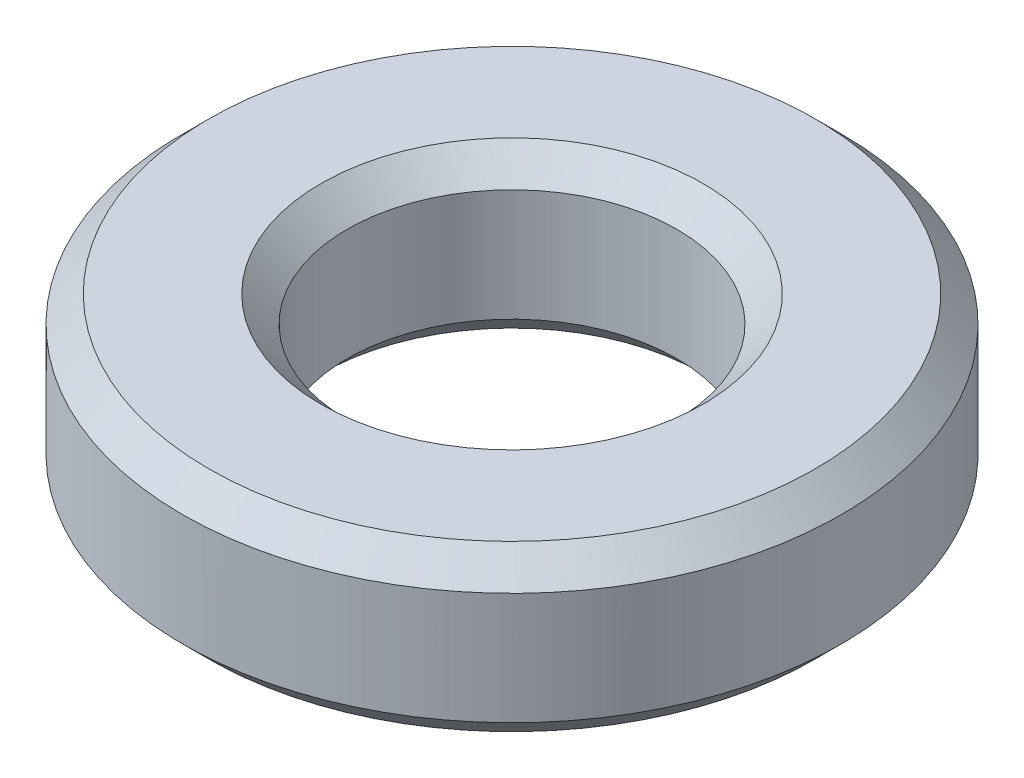
ISO-10303-21;
HEADER;
FILE_DESCRIPTION(('STEP AP214'),'2;1');
FILE_NAME('part.step','',(''),(''),'','','');
FILE_SCHEMA(('AUTOMOTIVE_DESIGN { 1 0 10303 214 1 1 1 1 }'));
ENDSEC;
DATA;
#1=APPLICATION_CONTEXT('core data for automotive mechanical design processes');
#2=APPLICATION_PROTOCOL_DEFINITION('international standard','automotive_design',2000,#1);
#3=PRODUCT_CONTEXT('',#1,'mechanical');
#4=PRODUCT('Part','Part','',(#3));
#5=PRODUCT_RELATED_PRODUCT_CATEGORY('part','',(#4));
#6=PRODUCT_DEFINITION_FORMATION('','',#4);
#7=PRODUCT_DEFINITION_CONTEXT('part definition',#1,'design');
#8=PRODUCT_DEFINITION('design','',#6,#7);
#9=PRODUCT_DEFINITION_SHAPE('','',#8);
#10=(LENGTH_UNIT() NAMED_UNIT(*) SI_UNIT(.MILLI.,.METRE.));
#11=(NAMED_UNIT(*) PLANE_ANGLE_UNIT() SI_UNIT($,.RADIAN.));
#12=(NAMED_UNIT(*) SI_UNIT($,.STERADIAN.) SOLID_ANGLE_UNIT());
#13=UNCERTAINTY_MEASURE_WITH_UNIT(LENGTH_MEASURE(1.E-05),#10,'distance_accuracy_value','');
#14=(GEOMETRIC_REPRESENTATION_CONTEXT(3) GLOBAL_UNCERTAINTY_ASSIGNED_CONTEXT((#13)) GLOBAL_UNIT_ASSIGNED_CONTEXT((#10,
#11,#12)) REPRESENTATION_CONTEXT('',''));
#15=CARTESIAN_POINT('',(0.,0.,0.));
#16=DIRECTION('',(0.,0.,1.));
#17=DIRECTION('',(1.,0.,0.));
#18=AXIS2_PLACEMENT_3D('',#15,#16,#17);
#19=CARTESIAN_POINT('',(0.,0.,0.));
#20=DIRECTION('',(0.,-1.,0.));
#21=DIRECTION('',(0.,0.,-1.));
#22=AXIS2_PLACEMENT_3D('',#19,#20,#21);
#23=CYLINDRICAL_SURFACE('',#22,1.5875);
#24=CARTESIAN_POINT('',(0.,0.539749999999998,0.));
#25=DIRECTION('',(0.,1.,0.));
#26=DIRECTION('',(0.,0.,1.));
#27=AXIS2_PLACEMENT_3D('',#24,#25,#26);
#28=CIRCLE('',#27,1.5875);
#29=CARTESIAN_POINT('',(0.,0.539749999999998,1.5875));
#30=VERTEX_POINT('',#29);
#31=EDGE_CURVE('E10',#30,#30,#28,.T.);
#32=ORIENTED_EDGE('',*,*,#31,.T.);
#33=EDGE_LOOP('',(#32));
#34=FACE_BOUND('',#33,.T.);
#35=CARTESIAN_POINT('',(0.,-0.539749999999999,0.));
#36=DIRECTION('',(0.,-1.,0.));
#37=DIRECTION('',(0.,0.,-1.));
#38=AXIS2_PLACEMENT_3D('',#35,#36,#37);
#39=CIRCLE('',#38,1.5875);
#40=CARTESIAN_POINT('',(0.,-0.539749999999999,-1.5875));
#41=VERTEX_POINT('',#40);
#42=EDGE_CURVE('E37',#41,#41,#39,.T.);
#43=ORIENTED_EDGE('',*,*,#42,.T.);
#44=EDGE_LOOP('',(#43));
#45=FACE_BOUND('',#44,.T.);
#46=ADVANCED_FACE('F30',(#34,#45),#23,.F.);
#47=CARTESIAN_POINT('',(1.5875,0.79375,0.));
#48=DIRECTION('',(0.,1.,0.));
#49=DIRECTION('',(0.,0.,1.));
#50=AXIS2_PLACEMENT_3D('',#47,#48,#49);
#51=PLANE('',#50);
#52=CARTESIAN_POINT('',(0.,0.79375,0.));
#53=DIRECTION('',(0.,1.,0.));
#54=DIRECTION('',(0.,0.,1.));
#55=AXIS2_PLACEMENT_3D('',#52,#53,#54);
#56=CIRCLE('',#55,2.921);
#57=CARTESIAN_POINT('',(0.,0.79375,2.921));
#58=VERTEX_POINT('',#57);
#59=EDGE_CURVE('E41',#58,#58,#56,.T.);
#60=ORIENTED_EDGE('',*,*,#59,.T.);
#61=EDGE_LOOP('',(#60));
#62=FACE_BOUND('',#61,.T.);
#63=CARTESIAN_POINT('',(0.,0.79375,0.));
#64=DIRECTION('',(0.,1.,0.));
#65=DIRECTION('',(0.,0.,1.));
#66=AXIS2_PLACEMENT_3D('',#63,#64,#65);
#67=CIRCLE('',#66,1.8415);
#68=CARTESIAN_POINT('',(0.,0.79375,1.8415));
#69=VERTEX_POINT('',#68);
#70=EDGE_CURVE('E45',#69,#69,#67,.F.);
#71=ORIENTED_EDGE('',*,*,#70,.T.);
#72=EDGE_LOOP('',(#71));
#73=FACE_BOUND('',#72,.T.);
#74=ADVANCED_FACE('F74',(#62,#73),#51,.T.);
#75=CARTESIAN_POINT('',(0.,0.,0.));
#76=DIRECTION('',(0.,-1.,0.));
#77=DIRECTION('',(0.,0.,-1.));
#78=AXIS2_PLACEMENT_3D('',#75,#76,#77);
#79=CYLINDRICAL_SURFACE('',#78,3.175);
#80=CARTESIAN_POINT('',(0.,-0.53975,0.));
#81=DIRECTION('',(0.,-1.,0.));
#82=DIRECTION('',(0.,0.,-1.));
#83=AXIS2_PLACEMENT_3D('',#80,#81,#82);
#84=CIRCLE('',#83,3.175);
#85=CARTESIAN_POINT('',(0.,-0.53975,-3.175));
#86=VERTEX_POINT('',#85);
#87=EDGE_CURVE('E50',#86,#86,#84,.F.);
#88=ORIENTED_EDGE('',*,*,#87,.T.);
#89=EDGE_LOOP('',(#88));
#90=FACE_BOUND('',#89,.T.);
#91=CARTESIAN_POINT('',(0.,0.539749999999999,0.));
#92=DIRECTION('',(0.,1.,0.));
#93=DIRECTION('',(0.,0.,1.));
#94=AXIS2_PLACEMENT_3D('',#91,#92,#93);
#95=CIRCLE('',#94,3.175);
#96=CARTESIAN_POINT('',(0.,0.539749999999999,3.175));
#97=VERTEX_POINT('',#96);
#98=EDGE_CURVE('E53',#97,#97,#95,.F.);
#99=ORIENTED_EDGE('',*,*,#98,.T.);
#100=EDGE_LOOP('',(#99));
#101=FACE_BOUND('',#100,.T.);
#102=ADVANCED_FACE('F79',(#90,#101),#79,.T.);
#103=CARTESIAN_POINT('',(3.175,-0.79375,0.));
#104=DIRECTION('',(0.,-1.,0.));
#105=DIRECTION('',(0.,0.,-1.));
#106=AXIS2_PLACEMENT_3D('',#103,#104,#105);
#107=PLANE('',#106);
#108=CARTESIAN_POINT('',(0.,-0.79375,0.));
#109=DIRECTION('',(0.,-1.,0.));
#110=DIRECTION('',(0.,0.,-1.));
#111=AXIS2_PLACEMENT_3D('',#108,#109,#110);
#112=CIRCLE('',#111,2.921);
#113=CARTESIAN_POINT('',(0.,-0.79375,-2.921));
#114=VERTEX_POINT('',#113);
#115=EDGE_CURVE('E56',#114,#114,#112,.T.);
#116=ORIENTED_EDGE('',*,*,#115,.T.);
#117=EDGE_LOOP('',(#116));
#118=FACE_BOUND('',#117,.T.);
#119=CARTESIAN_POINT('',(0.,-0.79375,0.));
#120=DIRECTION('',(0.,-1.,0.));
#121=DIRECTION('',(0.,0.,-1.));
#122=AXIS2_PLACEMENT_3D('',#119,#120,#121);
#123=CIRCLE('',#122,1.8415);
#124=CARTESIAN_POINT('',(0.,-0.79375,-1.8415));
#125=VERTEX_POINT('',#124);
#126=EDGE_CURVE('E59',#125,#125,#123,.F.);
#127=ORIENTED_EDGE('',*,*,#126,.T.);
#128=EDGE_LOOP('',(#127));
#129=FACE_BOUND('',#128,.T.);
#130=ADVANCED_FACE('F63',(#118,#129),#107,.T.);
#131=CARTESIAN_POINT('',(0.,-0.79375,0.));
#132=DIRECTION('',(0.,1.,0.));
#133=DIRECTION('',(0.,0.,1.));
#134=AXIS2_PLACEMENT_3D('',#131,#132,#133);
#135=CONICAL_SURFACE('',#134,2.921,0.785398163397447);
#136=ORIENTED_EDGE('',*,*,#87,.F.);
#137=EDGE_LOOP('',(#136));
#138=FACE_BOUND('',#137,.T.);
#139=ORIENTED_EDGE('',*,*,#115,.F.);
#140=EDGE_LOOP('',(#139));
#141=FACE_BOUND('',#140,.T.);
#142=ADVANCED_FACE('F84',(#138,#141),#135,.T.);
#143=CARTESIAN_POINT('',(0.,0.539749999999999,0.));
#144=DIRECTION('',(0.,-1.,0.));
#145=DIRECTION('',(0.,0.,-1.));
#146=AXIS2_PLACEMENT_3D('',#143,#144,#145);
#147=CONICAL_SURFACE('',#146,3.175,0.785398163397449);
#148=ORIENTED_EDGE('',*,*,#59,.F.);
#149=EDGE_LOOP('',(#148));
#150=FACE_BOUND('',#149,.T.);
#151=ORIENTED_EDGE('',*,*,#98,.F.);
#152=EDGE_LOOP('',(#151));
#153=FACE_BOUND('',#152,.T.);
#154=ADVANCED_FACE('F71',(#150,#153),#147,.T.);
#155=CARTESIAN_POINT('',(0.,0.79375,0.));
#156=DIRECTION('',(0.,1.,0.));
#157=DIRECTION('',(0.,0.,1.));
#158=AXIS2_PLACEMENT_3D('',#155,#156,#157);
#159=CONICAL_SURFACE('',#158,1.8415,0.785398163397447);
#160=ORIENTED_EDGE('',*,*,#31,.F.);
#161=EDGE_LOOP('',(#160));
#162=FACE_BOUND('',#161,.T.);
#163=ORIENTED_EDGE('',*,*,#70,.F.);
#164=EDGE_LOOP('',(#163));
#165=FACE_BOUND('',#164,.T.);
#166=ADVANCED_FACE('F67',(#162,#165),#159,.F.);
#167=CARTESIAN_POINT('',(0.,-0.539749999999999,0.));
#168=DIRECTION('',(0.,-1.,0.));
#169=DIRECTION('',(0.,0.,-1.));
#170=AXIS2_PLACEMENT_3D('',#167,#168,#169);
#171=CONICAL_SURFACE('',#170,1.5875,0.785398163397448);
#172=ORIENTED_EDGE('',*,*,#126,.F.);
#173=EDGE_LOOP('',(#172));
#174=FACE_BOUND('',#173,.T.);
#175=ORIENTED_EDGE('',*,*,#42,.F.);
#176=EDGE_LOOP('',(#175));
#177=FACE_BOUND('',#176,.T.);
#178=ADVANCED_FACE('F32',(#174,#177),#171,.F.);
#179=CLOSED_SHELL('',(#46,#74,#102,#130,#142,#154,#166,#178));
#180=MANIFOLD_SOLID_BREP('B2',#179);
#181=ADVANCED_BREP_SHAPE_REPRESENTATION('',(#18,#180),#14);
#182=SHAPE_DEFINITION_REPRESENTATION(#9,#181);
ENDSEC;
END-ISO-10303-21;
